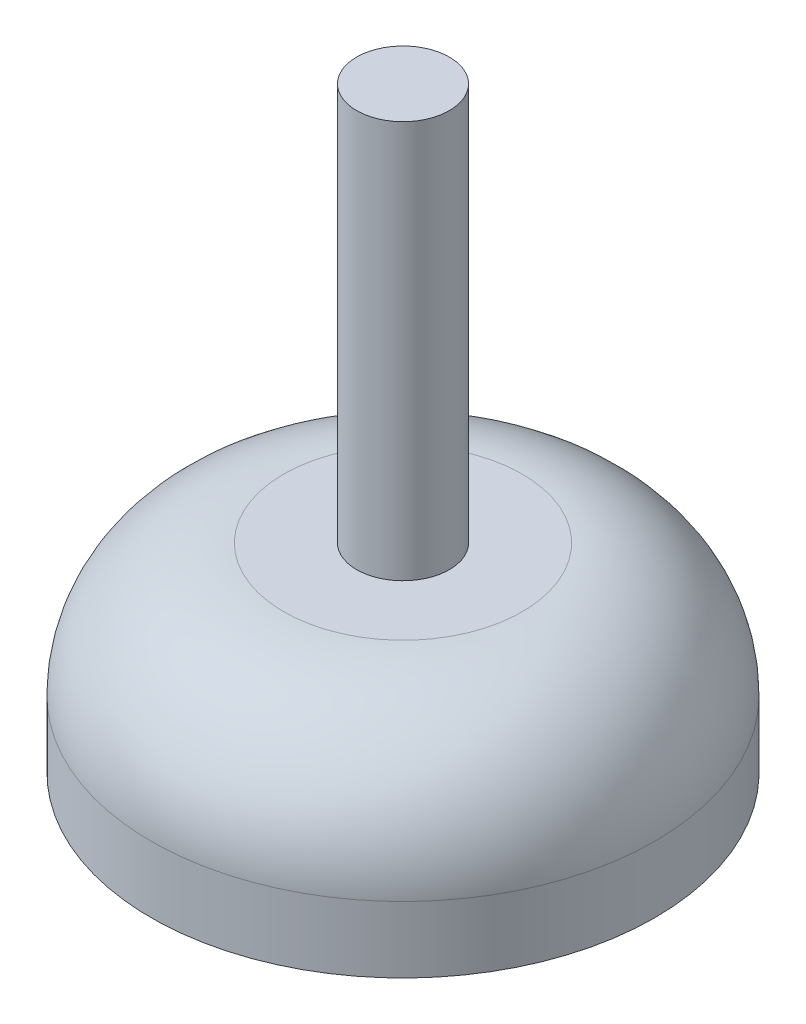
ISO-10303-21;
HEADER;
FILE_DESCRIPTION(('STEP AP214'),'2;1');
FILE_NAME('part.step','',(''),(''),'','','');
FILE_SCHEMA(('AUTOMOTIVE_DESIGN { 1 0 10303 214 1 1 1 1 }'));
ENDSEC;
DATA;
#1=APPLICATION_CONTEXT('core data for automotive mechanical design processes');
#2=APPLICATION_PROTOCOL_DEFINITION('international standard','automotive_design',2000,#1);
#3=PRODUCT_CONTEXT('',#1,'mechanical');
#4=PRODUCT('Part','Part','',(#3));
#5=PRODUCT_RELATED_PRODUCT_CATEGORY('part','',(#4));
#6=PRODUCT_DEFINITION_FORMATION('','',#4);
#7=PRODUCT_DEFINITION_CONTEXT('part definition',#1,'design');
#8=PRODUCT_DEFINITION('design','',#6,#7);
#9=PRODUCT_DEFINITION_SHAPE('','',#8);
#10=(LENGTH_UNIT() NAMED_UNIT(*) SI_UNIT(.MILLI.,.METRE.));
#11=(NAMED_UNIT(*) PLANE_ANGLE_UNIT() SI_UNIT($,.RADIAN.));
#12=(NAMED_UNIT(*) SI_UNIT($,.STERADIAN.) SOLID_ANGLE_UNIT());
#13=UNCERTAINTY_MEASURE_WITH_UNIT(LENGTH_MEASURE(1.E-05),#10,'distance_accuracy_value','');
#14=(GEOMETRIC_REPRESENTATION_CONTEXT(3) GLOBAL_UNCERTAINTY_ASSIGNED_CONTEXT((#13)) GLOBAL_UNIT_ASSIGNED_CONTEXT((#10,
#11,#12)) REPRESENTATION_CONTEXT('',''));
#15=CARTESIAN_POINT('',(0.,0.,0.));
#16=DIRECTION('',(0.,0.,1.));
#17=DIRECTION('',(1.,0.,0.));
#18=AXIS2_PLACEMENT_3D('',#15,#16,#17);
#19=CARTESIAN_POINT('',(-3.5,0.,0.));
#20=DIRECTION('',(0.,1.,0.));
#21=DIRECTION('',(-1.,0.,0.));
#22=AXIS2_PLACEMENT_3D('',#19,#20,#21);
#23=PLANE('',#22);
#24=CARTESIAN_POINT('',(0.,0.,0.));
#25=DIRECTION('',(0.,1.,0.));
#26=DIRECTION('',(-1.,0.,0.));
#27=AXIS2_PLACEMENT_3D('',#24,#25,#26);
#28=CIRCLE('',#27,3.5);
#29=CARTESIAN_POINT('',(-3.5,0.,0.));
#30=VERTEX_POINT('',#29);
#31=EDGE_CURVE('E53',#30,#30,#28,.T.);
#32=ORIENTED_EDGE('',*,*,#31,.T.);
#33=EDGE_LOOP('',(#32));
#34=FACE_BOUND('',#33,.T.);
#35=ADVANCED_FACE('F33',(#34),#23,.T.);
#36=CARTESIAN_POINT('',(0.,-45.,0.));
#37=DIRECTION('',(0.,-1.,0.));
#38=DIRECTION('',(1.,0.,0.));
#39=AXIS2_PLACEMENT_3D('',#36,#37,#38);
#40=PLANE('',#39);
#41=CARTESIAN_POINT('',(0.,-45.,0.));
#42=DIRECTION('',(0.,1.,0.));
#43=DIRECTION('',(-1.,0.,0.));
#44=AXIS2_PLACEMENT_3D('',#41,#42,#43);
#45=CIRCLE('',#44,19.);
#46=CARTESIAN_POINT('',(-19.,-45.,0.));
#47=VERTEX_POINT('',#46);
#48=EDGE_CURVE('E44',#47,#47,#45,.T.);
#49=ORIENTED_EDGE('',*,*,#48,.F.);
#50=EDGE_LOOP('',(#49));
#51=FACE_BOUND('',#50,.T.);
#52=ADVANCED_FACE('F71',(#51),#40,.T.);
#53=CARTESIAN_POINT('',(0.,0.,0.));
#54=DIRECTION('',(0.,1.,0.));
#55=DIRECTION('',(-1.,0.,0.));
#56=AXIS2_PLACEMENT_3D('',#53,#54,#55);
#57=CYLINDRICAL_SURFACE('',#56,19.);
#58=CARTESIAN_POINT('',(0.,-40.,0.));
#59=DIRECTION('',(0.,1.,0.));
#60=DIRECTION('',(-1.,0.,0.));
#61=AXIS2_PLACEMENT_3D('',#58,#59,#60);
#62=CIRCLE('',#61,19.);
#63=CARTESIAN_POINT('',(-19.,-40.,0.));
#64=VERTEX_POINT('',#63);
#65=EDGE_CURVE('E10',#64,#64,#62,.F.);
#66=ORIENTED_EDGE('',*,*,#65,.T.);
#67=EDGE_LOOP('',(#66));
#68=FACE_BOUND('',#67,.T.);
#69=ORIENTED_EDGE('',*,*,#48,.T.);
#70=EDGE_LOOP('',(#69));
#71=FACE_BOUND('',#70,.T.);
#72=ADVANCED_FACE('F68',(#68,#71),#57,.T.);
#73=CARTESIAN_POINT('',(-19.,-30.,0.));
#74=DIRECTION('',(0.,1.,0.));
#75=DIRECTION('',(-1.,0.,0.));
#76=AXIS2_PLACEMENT_3D('',#73,#74,#75);
#77=PLANE('',#76);
#78=CARTESIAN_POINT('',(0.,-30.,0.));
#79=DIRECTION('',(0.,1.,0.));
#80=DIRECTION('',(-1.,0.,0.));
#81=AXIS2_PLACEMENT_3D('',#78,#79,#80);
#82=CIRCLE('',#81,9.);
#83=CARTESIAN_POINT('',(-8.99999999999999,-30.,0.));
#84=VERTEX_POINT('',#83);
#85=EDGE_CURVE('E40',#84,#84,#82,.T.);
#86=ORIENTED_EDGE('',*,*,#85,.T.);
#87=EDGE_LOOP('',(#86));
#88=FACE_BOUND('',#87,.T.);
#89=CARTESIAN_POINT('',(0.,-30.,0.));
#90=DIRECTION('',(0.,1.,0.));
#91=DIRECTION('',(-1.,0.,0.));
#92=AXIS2_PLACEMENT_3D('',#89,#90,#91);
#93=CIRCLE('',#92,3.5);
#94=CARTESIAN_POINT('',(-3.5,-30.,0.));
#95=VERTEX_POINT('',#94);
#96=EDGE_CURVE('E48',#95,#95,#93,.T.);
#97=ORIENTED_EDGE('',*,*,#96,.F.);
#98=EDGE_LOOP('',(#97));
#99=FACE_BOUND('',#98,.T.);
#100=ADVANCED_FACE('F60',(#88,#99),#77,.T.);
#101=CARTESIAN_POINT('',(0.,0.,0.));
#102=DIRECTION('',(0.,1.,0.));
#103=DIRECTION('',(-1.,0.,0.));
#104=AXIS2_PLACEMENT_3D('',#101,#102,#103);
#105=CYLINDRICAL_SURFACE('',#104,3.5);
#106=ORIENTED_EDGE('',*,*,#96,.T.);
#107=EDGE_LOOP('',(#106));
#108=FACE_BOUND('',#107,.T.);
#109=ORIENTED_EDGE('',*,*,#31,.F.);
#110=EDGE_LOOP('',(#109));
#111=FACE_BOUND('',#110,.T.);
#112=ADVANCED_FACE('F58',(#108,#111),#105,.T.);
#113=CARTESIAN_POINT('',(0.,-40.,0.));
#114=DIRECTION('',(0.,1.,0.));
#115=DIRECTION('',(-1.,0.,0.));
#116=AXIS2_PLACEMENT_3D('',#113,#114,#115);
#117=DEGENERATE_TOROIDAL_SURFACE('',#116,9.,10.,.T.);
#118=ORIENTED_EDGE('',*,*,#65,.F.);
#119=EDGE_LOOP('',(#118));
#120=FACE_BOUND('',#119,.T.);
#121=ORIENTED_EDGE('',*,*,#85,.F.);
#122=EDGE_LOOP('',(#121));
#123=FACE_BOUND('',#122,.T.);
#124=ADVANCED_FACE('F35',(#120,#123),#117,.T.);
#125=CLOSED_SHELL('',(#35,#52,#72,#100,#112,#124));
#126=MANIFOLD_SOLID_BREP('B2',#125);
#127=ADVANCED_BREP_SHAPE_REPRESENTATION('',(#18,#126),#14);
#128=SHAPE_DEFINITION_REPRESENTATION(#9,#127);
ENDSEC;
END-ISO-10303-21;
